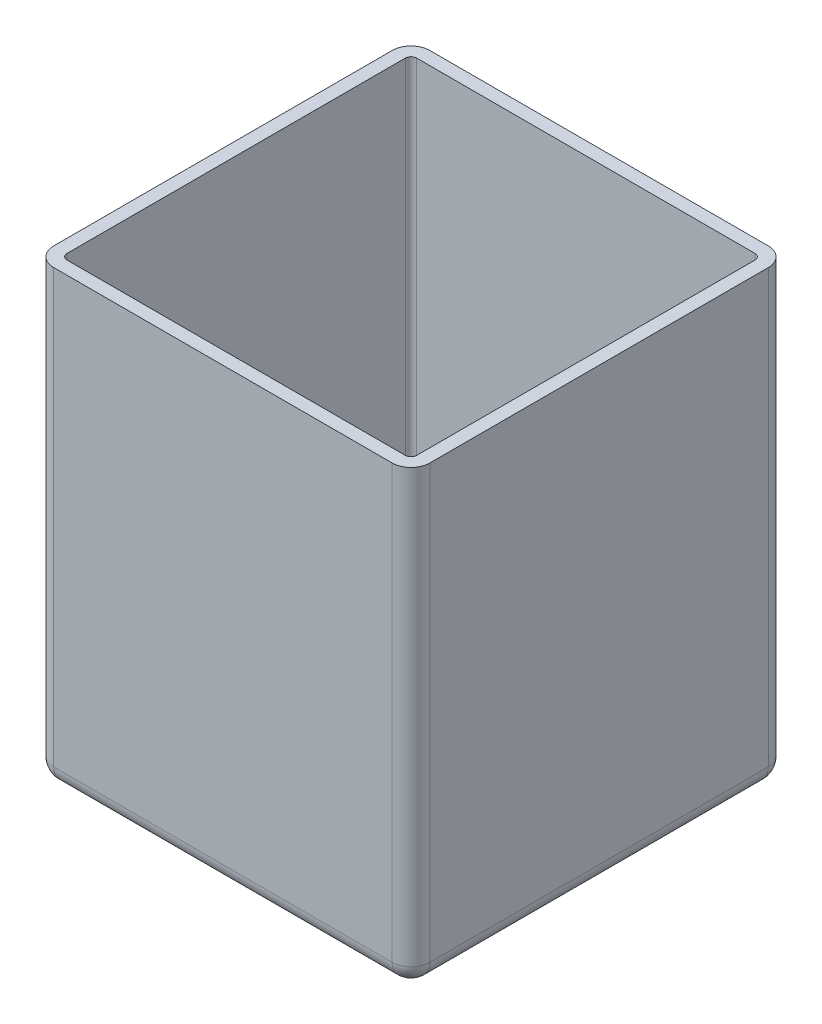
ISO-10303-21;
HEADER;
FILE_DESCRIPTION(('STEP AP214'),'2;1');
FILE_NAME('part.step','',(''),(''),'','','');
FILE_SCHEMA(('AUTOMOTIVE_DESIGN { 1 0 10303 214 1 1 1 1 }'));
ENDSEC;
DATA;
#1=APPLICATION_CONTEXT('core data for automotive mechanical design processes');
#2=APPLICATION_PROTOCOL_DEFINITION('international standard','automotive_design',2000,#1);
#3=PRODUCT_CONTEXT('',#1,'mechanical');
#4=PRODUCT('Part','Part','',(#3));
#5=PRODUCT_RELATED_PRODUCT_CATEGORY('part','',(#4));
#6=PRODUCT_DEFINITION_FORMATION('','',#4);
#7=PRODUCT_DEFINITION_CONTEXT('part definition',#1,'design');
#8=PRODUCT_DEFINITION('design','',#6,#7);
#9=PRODUCT_DEFINITION_SHAPE('','',#8);
#10=(LENGTH_UNIT() NAMED_UNIT(*) SI_UNIT(.MILLI.,.METRE.));
#11=(NAMED_UNIT(*) PLANE_ANGLE_UNIT() SI_UNIT($,.RADIAN.));
#12=(NAMED_UNIT(*) SI_UNIT($,.STERADIAN.) SOLID_ANGLE_UNIT());
#13=UNCERTAINTY_MEASURE_WITH_UNIT(LENGTH_MEASURE(1.E-05),#10,'distance_accuracy_value','');
#14=(GEOMETRIC_REPRESENTATION_CONTEXT(3) GLOBAL_UNCERTAINTY_ASSIGNED_CONTEXT((#13)) GLOBAL_UNIT_ASSIGNED_CONTEXT((#10,
#11,#12)) REPRESENTATION_CONTEXT('',''));
#15=CARTESIAN_POINT('',(0.,0.,0.));
#16=DIRECTION('',(0.,0.,1.));
#17=DIRECTION('',(1.,0.,0.));
#18=AXIS2_PLACEMENT_3D('',#15,#16,#17);
#19=CARTESIAN_POINT('',(-100.,240.,-100.));
#20=DIRECTION('',(1.,0.,0.));
#21=DIRECTION('',(0.,0.,-1.));
#22=AXIS2_PLACEMENT_3D('',#19,#20,#21);
#23=PLANE('',#22);
#24=DIRECTION('',(0.,0.,1.));
#25=VECTOR('',#24,1.);
#26=CARTESIAN_POINT('',(-100.,10.,100.));
#27=LINE('',#26,#25);
#28=CARTESIAN_POINT('',(-100.,10.,-90.));
#29=VERTEX_POINT('',#28);
#30=CARTESIAN_POINT('',(-100.,10.,90.));
#31=VERTEX_POINT('',#30);
#32=EDGE_CURVE('E60',#29,#31,#27,.T.);
#33=ORIENTED_EDGE('',*,*,#32,.T.);
#34=DIRECTION('',(0.,-1.,0.));
#35=VECTOR('',#34,1.);
#36=CARTESIAN_POINT('',(-100.,240.,90.));
#37=LINE('',#36,#35);
#38=CARTESIAN_POINT('',(-100.,240.,90.));
#39=VERTEX_POINT('',#38);
#40=EDGE_CURVE('E288',#31,#39,#37,.F.);
#41=ORIENTED_EDGE('',*,*,#40,.T.);
#42=DIRECTION('',(0.,0.,1.));
#43=VECTOR('',#42,1.);
#44=CARTESIAN_POINT('',(-100.,240.,-100.));
#45=LINE('',#44,#43);
#46=CARTESIAN_POINT('',(-100.,240.,-90.));
#47=VERTEX_POINT('',#46);
#48=EDGE_CURVE('E245',#47,#39,#45,.T.);
#49=ORIENTED_EDGE('',*,*,#48,.F.);
#50=DIRECTION('',(0.,-1.,0.));
#51=VECTOR('',#50,1.);
#52=CARTESIAN_POINT('',(-100.,240.,-90.));
#53=LINE('',#52,#51);
#54=EDGE_CURVE('E285',#47,#29,#53,.T.);
#55=ORIENTED_EDGE('',*,*,#54,.T.);
#56=EDGE_LOOP('',(#33,#41,#49,#55));
#57=FACE_BOUND('',#56,.T.);
#58=ADVANCED_FACE('F35',(#57),#23,.F.);
#59=CARTESIAN_POINT('',(100.,240.,100.));
#60=DIRECTION('',(0.,0.,-1.));
#61=DIRECTION('',(-1.,0.,0.));
#62=AXIS2_PLACEMENT_3D('',#59,#60,#61);
#63=PLANE('',#62);
#64=DIRECTION('',(1.,0.,0.));
#65=VECTOR('',#64,1.);
#66=CARTESIAN_POINT('',(100.,240.,100.));
#67=LINE('',#66,#65);
#68=CARTESIAN_POINT('',(-90.,240.,100.));
#69=VERTEX_POINT('',#68);
#70=CARTESIAN_POINT('',(90.0000000000001,240.,100.));
#71=VERTEX_POINT('',#70);
#72=EDGE_CURVE('E248',#69,#71,#67,.T.);
#73=ORIENTED_EDGE('',*,*,#72,.F.);
#74=DIRECTION('',(0.,-1.,0.));
#75=VECTOR('',#74,1.);
#76=CARTESIAN_POINT('',(-90.,240.,100.));
#77=LINE('',#76,#75);
#78=CARTESIAN_POINT('',(-90.,10.,100.));
#79=VERTEX_POINT('',#78);
#80=EDGE_CURVE('E262',#69,#79,#77,.T.);
#81=ORIENTED_EDGE('',*,*,#80,.T.);
#82=DIRECTION('',(1.,0.,0.));
#83=VECTOR('',#82,1.);
#84=CARTESIAN_POINT('',(100.,10.,100.));
#85=LINE('',#84,#83);
#86=CARTESIAN_POINT('',(90.0000000000001,10.,100.));
#87=VERTEX_POINT('',#86);
#88=EDGE_CURVE('E259',#79,#87,#85,.T.);
#89=ORIENTED_EDGE('',*,*,#88,.T.);
#90=DIRECTION('',(0.,-1.,0.));
#91=VECTOR('',#90,1.);
#92=CARTESIAN_POINT('',(90.0000000000001,240.,100.));
#93=LINE('',#92,#91);
#94=EDGE_CURVE('E257',#87,#71,#93,.F.);
#95=ORIENTED_EDGE('',*,*,#94,.T.);
#96=EDGE_LOOP('',(#73,#81,#89,#95));
#97=FACE_BOUND('',#96,.T.);
#98=ADVANCED_FACE('F387',(#97),#63,.F.);
#99=CARTESIAN_POINT('',(100.,240.,-100.));
#100=DIRECTION('',(-1.,0.,0.));
#101=DIRECTION('',(0.,0.,1.));
#102=AXIS2_PLACEMENT_3D('',#99,#100,#101);
#103=PLANE('',#102);
#104=DIRECTION('',(0.,0.,-1.));
#105=VECTOR('',#104,1.);
#106=CARTESIAN_POINT('',(100.,10.,-100.));
#107=LINE('',#106,#105);
#108=CARTESIAN_POINT('',(100.,10.,90.));
#109=VERTEX_POINT('',#108);
#110=CARTESIAN_POINT('',(100.,10.,-90.));
#111=VERTEX_POINT('',#110);
#112=EDGE_CURVE('E275',#109,#111,#107,.T.);
#113=ORIENTED_EDGE('',*,*,#112,.T.);
#114=DIRECTION('',(0.,-1.,0.));
#115=VECTOR('',#114,1.);
#116=CARTESIAN_POINT('',(100.,240.,-90.));
#117=LINE('',#116,#115);
#118=CARTESIAN_POINT('',(100.,240.,-90.));
#119=VERTEX_POINT('',#118);
#120=EDGE_CURVE('E277',#111,#119,#117,.F.);
#121=ORIENTED_EDGE('',*,*,#120,.T.);
#122=DIRECTION('',(0.,0.,-1.));
#123=VECTOR('',#122,1.);
#124=CARTESIAN_POINT('',(100.,240.,-100.));
#125=LINE('',#124,#123);
#126=CARTESIAN_POINT('',(100.,240.,90.));
#127=VERTEX_POINT('',#126);
#128=EDGE_CURVE('E251',#127,#119,#125,.T.);
#129=ORIENTED_EDGE('',*,*,#128,.F.);
#130=DIRECTION('',(0.,-1.,0.));
#131=VECTOR('',#130,1.);
#132=CARTESIAN_POINT('',(100.,240.,90.));
#133=LINE('',#132,#131);
#134=EDGE_CURVE('E273',#127,#109,#133,.T.);
#135=ORIENTED_EDGE('',*,*,#134,.T.);
#136=EDGE_LOOP('',(#113,#121,#129,#135));
#137=FACE_BOUND('',#136,.T.);
#138=ADVANCED_FACE('F390',(#137),#103,.F.);
#139=CARTESIAN_POINT('',(100.,240.,-100.));
#140=DIRECTION('',(0.,0.,1.));
#141=DIRECTION('',(1.,0.,0.));
#142=AXIS2_PLACEMENT_3D('',#139,#140,#141);
#143=PLANE('',#142);
#144=DIRECTION('',(-1.,0.,0.));
#145=VECTOR('',#144,1.);
#146=CARTESIAN_POINT('',(-100.,10.,-100.));
#147=LINE('',#146,#145);
#148=CARTESIAN_POINT('',(90.,10.,-100.));
#149=VERTEX_POINT('',#148);
#150=CARTESIAN_POINT('',(-90.,10.,-100.));
#151=VERTEX_POINT('',#150);
#152=EDGE_CURVE('E281',#149,#151,#147,.T.);
#153=ORIENTED_EDGE('',*,*,#152,.T.);
#154=DIRECTION('',(0.,-1.,0.));
#155=VECTOR('',#154,1.);
#156=CARTESIAN_POINT('',(-90.,240.,-100.));
#157=LINE('',#156,#155);
#158=CARTESIAN_POINT('',(-90.,240.,-100.));
#159=VERTEX_POINT('',#158);
#160=EDGE_CURVE('E283',#151,#159,#157,.F.);
#161=ORIENTED_EDGE('',*,*,#160,.T.);
#162=DIRECTION('',(-1.,0.,0.));
#163=VECTOR('',#162,1.);
#164=CARTESIAN_POINT('',(100.,240.,-100.));
#165=LINE('',#164,#163);
#166=CARTESIAN_POINT('',(90.,240.,-100.));
#167=VERTEX_POINT('',#166);
#168=EDGE_CURVE('E254',#167,#159,#165,.T.);
#169=ORIENTED_EDGE('',*,*,#168,.F.);
#170=DIRECTION('',(0.,-1.,0.));
#171=VECTOR('',#170,1.);
#172=CARTESIAN_POINT('',(90.,240.,-100.));
#173=LINE('',#172,#171);
#174=EDGE_CURVE('E279',#167,#149,#173,.T.);
#175=ORIENTED_EDGE('',*,*,#174,.T.);
#176=EDGE_LOOP('',(#153,#161,#169,#175));
#177=FACE_BOUND('',#176,.T.);
#178=ADVANCED_FACE('F355',(#177),#143,.F.);
#179=CARTESIAN_POINT('',(0.,240.,0.));
#180=DIRECTION('',(0.,-1.,0.));
#181=DIRECTION('',(0.,0.,-1.));
#182=AXIS2_PLACEMENT_3D('',#179,#180,#181);
#183=PLANE('',#182);
#184=DIRECTION('',(0.,0.,1.));
#185=VECTOR('',#184,1.);
#186=CARTESIAN_POINT('',(-93.,240.,0.));
#187=LINE('',#186,#185);
#188=CARTESIAN_POINT('',(-93.,240.,-90.));
#189=VERTEX_POINT('',#188);
#190=CARTESIAN_POINT('',(-93.,240.,90.));
#191=VERTEX_POINT('',#190);
#192=EDGE_CURVE('E192',#189,#191,#187,.T.);
#193=ORIENTED_EDGE('',*,*,#192,.F.);
#194=CARTESIAN_POINT('',(-90.,240.,-90.));
#195=DIRECTION('',(0.,-1.,0.));
#196=DIRECTION('',(0.,0.,-1.));
#197=AXIS2_PLACEMENT_3D('',#194,#195,#196);
#198=CIRCLE('',#197,3.);
#199=CARTESIAN_POINT('',(-90.,240.,-93.));
#200=VERTEX_POINT('',#199);
#201=EDGE_CURVE('E234',#200,#189,#198,.F.);
#202=ORIENTED_EDGE('',*,*,#201,.F.);
#203=DIRECTION('',(-1.,0.,0.));
#204=VECTOR('',#203,1.);
#205=CARTESIAN_POINT('',(0.,240.,-93.));
#206=LINE('',#205,#204);
#207=CARTESIAN_POINT('',(90.,240.,-93.));
#208=VERTEX_POINT('',#207);
#209=EDGE_CURVE('E52',#208,#200,#206,.T.);
#210=ORIENTED_EDGE('',*,*,#209,.F.);
#211=CARTESIAN_POINT('',(90.,240.,-90.));
#212=DIRECTION('',(0.,-1.,0.));
#213=DIRECTION('',(0.,0.,-1.));
#214=AXIS2_PLACEMENT_3D('',#211,#212,#213);
#215=CIRCLE('',#214,3.);
#216=CARTESIAN_POINT('',(93.,240.,-90.));
#217=VERTEX_POINT('',#216);
#218=EDGE_CURVE('E239',#217,#208,#215,.F.);
#219=ORIENTED_EDGE('',*,*,#218,.F.);
#220=DIRECTION('',(0.,0.,-1.));
#221=VECTOR('',#220,1.);
#222=CARTESIAN_POINT('',(93.,240.,0.));
#223=LINE('',#222,#221);
#224=CARTESIAN_POINT('',(93.,240.,90.));
#225=VERTEX_POINT('',#224);
#226=EDGE_CURVE('E237',#225,#217,#223,.T.);
#227=ORIENTED_EDGE('',*,*,#226,.F.);
#228=CARTESIAN_POINT('',(90.0000000000001,240.,90.));
#229=DIRECTION('',(0.,-1.,0.));
#230=DIRECTION('',(0.,0.,-1.));
#231=AXIS2_PLACEMENT_3D('',#228,#229,#230);
#232=CIRCLE('',#231,3.);
#233=CARTESIAN_POINT('',(90.0000000000001,240.,93.));
#234=VERTEX_POINT('',#233);
#235=EDGE_CURVE('E196',#234,#225,#232,.F.);
#236=ORIENTED_EDGE('',*,*,#235,.F.);
#237=DIRECTION('',(1.,0.,0.));
#238=VECTOR('',#237,1.);
#239=CARTESIAN_POINT('',(0.,240.,93.));
#240=LINE('',#239,#238);
#241=CARTESIAN_POINT('',(-90.,240.,93.));
#242=VERTEX_POINT('',#241);
#243=EDGE_CURVE('E229',#242,#234,#240,.T.);
#244=ORIENTED_EDGE('',*,*,#243,.F.);
#245=CARTESIAN_POINT('',(-90.,240.,90.));
#246=DIRECTION('',(0.,-1.,0.));
#247=DIRECTION('',(0.,0.,-1.));
#248=AXIS2_PLACEMENT_3D('',#245,#246,#247);
#249=CIRCLE('',#248,3.);
#250=EDGE_CURVE('E231',#191,#242,#249,.F.);
#251=ORIENTED_EDGE('',*,*,#250,.F.);
#252=EDGE_LOOP('',(#193,#202,#210,#219,#227,#236,#244,#251));
#253=FACE_BOUND('',#252,.T.);
#254=ORIENTED_EDGE('',*,*,#48,.T.);
#255=CARTESIAN_POINT('',(-90.,240.,90.));
#256=DIRECTION('',(0.,-1.,0.));
#257=DIRECTION('',(0.,0.,-1.));
#258=AXIS2_PLACEMENT_3D('',#255,#256,#257);
#259=CIRCLE('',#258,10.);
#260=EDGE_CURVE('E11',#39,#69,#259,.F.);
#261=ORIENTED_EDGE('',*,*,#260,.T.);
#262=ORIENTED_EDGE('',*,*,#72,.T.);
#263=CARTESIAN_POINT('',(90.0000000000001,240.,90.));
#264=DIRECTION('',(0.,-1.,0.));
#265=DIRECTION('',(0.,0.,-1.));
#266=AXIS2_PLACEMENT_3D('',#263,#264,#265);
#267=CIRCLE('',#266,10.);
#268=EDGE_CURVE('E290',#71,#127,#267,.F.);
#269=ORIENTED_EDGE('',*,*,#268,.T.);
#270=ORIENTED_EDGE('',*,*,#128,.T.);
#271=CARTESIAN_POINT('',(90.,240.,-90.));
#272=DIRECTION('',(0.,-1.,0.));
#273=DIRECTION('',(0.,0.,-1.));
#274=AXIS2_PLACEMENT_3D('',#271,#272,#273);
#275=CIRCLE('',#274,10.);
#276=EDGE_CURVE('E292',#119,#167,#275,.F.);
#277=ORIENTED_EDGE('',*,*,#276,.T.);
#278=ORIENTED_EDGE('',*,*,#168,.T.);
#279=CARTESIAN_POINT('',(-90.,240.,-90.));
#280=DIRECTION('',(0.,-1.,0.));
#281=DIRECTION('',(0.,0.,-1.));
#282=AXIS2_PLACEMENT_3D('',#279,#280,#281);
#283=CIRCLE('',#282,10.);
#284=EDGE_CURVE('E44',#159,#47,#283,.F.);
#285=ORIENTED_EDGE('',*,*,#284,.T.);
#286=EDGE_LOOP('',(#254,#261,#262,#269,#270,#277,#278,#285));
#287=FACE_BOUND('',#286,.T.);
#288=ADVANCED_FACE('F348',(#253,#287),#183,.F.);
#289=CARTESIAN_POINT('',(0.,0.,0.));
#290=DIRECTION('',(0.,-1.,0.));
#291=DIRECTION('',(0.,0.,-1.));
#292=AXIS2_PLACEMENT_3D('',#289,#290,#291);
#293=PLANE('',#292);
#294=DIRECTION('',(0.,0.,-1.));
#295=VECTOR('',#294,1.);
#296=CARTESIAN_POINT('',(90.0000000000001,0.,100.));
#297=LINE('',#296,#295);
#298=CARTESIAN_POINT('',(90.,0.,-90.));
#299=VERTEX_POINT('',#298);
#300=CARTESIAN_POINT('',(90.0000000000001,0.,90.));
#301=VERTEX_POINT('',#300);
#302=EDGE_CURVE('E268',#299,#301,#297,.F.);
#303=ORIENTED_EDGE('',*,*,#302,.T.);
#304=DIRECTION('',(1.,0.,0.));
#305=VECTOR('',#304,1.);
#306=CARTESIAN_POINT('',(-100.,0.,90.));
#307=LINE('',#306,#305);
#308=CARTESIAN_POINT('',(-90.,0.,90.));
#309=VERTEX_POINT('',#308);
#310=EDGE_CURVE('E270',#301,#309,#307,.F.);
#311=ORIENTED_EDGE('',*,*,#310,.T.);
#312=DIRECTION('',(0.,0.,1.));
#313=VECTOR('',#312,1.);
#314=CARTESIAN_POINT('',(-90.,0.,-100.));
#315=LINE('',#314,#313);
#316=CARTESIAN_POINT('',(-90.,0.,-90.));
#317=VERTEX_POINT('',#316);
#318=EDGE_CURVE('E264',#309,#317,#315,.F.);
#319=ORIENTED_EDGE('',*,*,#318,.T.);
#320=DIRECTION('',(-1.,0.,0.));
#321=VECTOR('',#320,1.);
#322=CARTESIAN_POINT('',(100.,0.,-90.));
#323=LINE('',#322,#321);
#324=EDGE_CURVE('E266',#317,#299,#323,.F.);
#325=ORIENTED_EDGE('',*,*,#324,.T.);
#326=EDGE_LOOP('',(#303,#311,#319,#325));
#327=FACE_BOUND('',#326,.T.);
#328=ADVANCED_FACE('F374',(#327),#293,.T.);
#329=CARTESIAN_POINT('',(-90.,240.,-90.));
#330=DIRECTION('',(0.,-1.,0.));
#331=DIRECTION('',(0.,0.,-1.));
#332=AXIS2_PLACEMENT_3D('',#329,#330,#331);
#333=CYLINDRICAL_SURFACE('',#332,10.);
#334=ORIENTED_EDGE('',*,*,#284,.F.);
#335=ORIENTED_EDGE('',*,*,#160,.F.);
#336=CARTESIAN_POINT('',(-90.,10.,-90.));
#337=DIRECTION('',(0.,-1.,0.));
#338=DIRECTION('',(0.,0.,-1.));
#339=AXIS2_PLACEMENT_3D('',#336,#337,#338);
#340=CIRCLE('',#339,10.);
#341=EDGE_CURVE('E321',#29,#151,#340,.T.);
#342=ORIENTED_EDGE('',*,*,#341,.F.);
#343=ORIENTED_EDGE('',*,*,#54,.F.);
#344=EDGE_LOOP('',(#334,#335,#342,#343));
#345=FACE_BOUND('',#344,.T.);
#346=ADVANCED_FACE('F37',(#345),#333,.T.);
#347=CARTESIAN_POINT('',(90.,240.,-90.));
#348=DIRECTION('',(0.,-1.,0.));
#349=DIRECTION('',(0.,0.,-1.));
#350=AXIS2_PLACEMENT_3D('',#347,#348,#349);
#351=CYLINDRICAL_SURFACE('',#350,10.);
#352=ORIENTED_EDGE('',*,*,#276,.F.);
#353=ORIENTED_EDGE('',*,*,#120,.F.);
#354=CARTESIAN_POINT('',(90.,10.,-90.));
#355=DIRECTION('',(0.,-1.,0.));
#356=DIRECTION('',(0.,0.,-1.));
#357=AXIS2_PLACEMENT_3D('',#354,#355,#356);
#358=CIRCLE('',#357,10.);
#359=EDGE_CURVE('E319',#149,#111,#358,.T.);
#360=ORIENTED_EDGE('',*,*,#359,.F.);
#361=ORIENTED_EDGE('',*,*,#174,.F.);
#362=EDGE_LOOP('',(#352,#353,#360,#361));
#363=FACE_BOUND('',#362,.T.);
#364=ADVANCED_FACE('F364',(#363),#351,.T.);
#365=CARTESIAN_POINT('',(100.,10.,-90.));
#366=DIRECTION('',(1.,0.,0.));
#367=DIRECTION('',(0.,0.,-1.));
#368=AXIS2_PLACEMENT_3D('',#365,#366,#367);
#369=CYLINDRICAL_SURFACE('',#368,10.);
#370=CARTESIAN_POINT('',(-90.,10.,-90.));
#371=DIRECTION('',(-1.,0.,0.));
#372=DIRECTION('',(0.,0.,1.));
#373=AXIS2_PLACEMENT_3D('',#370,#371,#372);
#374=CIRCLE('',#373,10.);
#375=EDGE_CURVE('E39',#151,#317,#374,.T.);
#376=ORIENTED_EDGE('',*,*,#375,.F.);
#377=ORIENTED_EDGE('',*,*,#152,.F.);
#378=CARTESIAN_POINT('',(90.,10.,-90.));
#379=DIRECTION('',(1.,0.,0.));
#380=DIRECTION('',(0.,0.,-1.));
#381=AXIS2_PLACEMENT_3D('',#378,#379,#380);
#382=CIRCLE('',#381,10.);
#383=EDGE_CURVE('E316',#299,#149,#382,.T.);
#384=ORIENTED_EDGE('',*,*,#383,.F.);
#385=ORIENTED_EDGE('',*,*,#324,.F.);
#386=EDGE_LOOP('',(#376,#377,#384,#385));
#387=FACE_BOUND('',#386,.T.);
#388=ADVANCED_FACE('F359',(#387),#369,.T.);
#389=CARTESIAN_POINT('',(-90.,10.,-90.));
#390=DIRECTION('',(0.,0.,1.));
#391=DIRECTION('',(1.,0.,0.));
#392=AXIS2_PLACEMENT_3D('',#389,#390,#391);
#393=SPHERICAL_SURFACE('',#392,10.);
#394=ORIENTED_EDGE('',*,*,#341,.T.);
#395=ORIENTED_EDGE('',*,*,#375,.T.);
#396=CARTESIAN_POINT('',(-90.,10.,-90.));
#397=DIRECTION('',(0.,0.,-1.));
#398=DIRECTION('',(-1.,0.,0.));
#399=AXIS2_PLACEMENT_3D('',#396,#397,#398);
#400=CIRCLE('',#399,10.);
#401=EDGE_CURVE('E313',#29,#317,#400,.F.);
#402=ORIENTED_EDGE('',*,*,#401,.F.);
#403=EDGE_LOOP('',(#394,#395,#402));
#404=FACE_BOUND('',#403,.T.);
#405=ADVANCED_FACE('F328',(#404),#393,.T.);
#406=CARTESIAN_POINT('',(90.,10.,-90.));
#407=DIRECTION('',(0.,0.,1.));
#408=DIRECTION('',(1.,0.,0.));
#409=AXIS2_PLACEMENT_3D('',#406,#407,#408);
#410=SPHERICAL_SURFACE('',#409,10.);
#411=ORIENTED_EDGE('',*,*,#383,.T.);
#412=ORIENTED_EDGE('',*,*,#359,.T.);
#413=CARTESIAN_POINT('',(90.,10.,-90.));
#414=DIRECTION('',(0.,0.,-1.));
#415=DIRECTION('',(-1.,0.,0.));
#416=AXIS2_PLACEMENT_3D('',#413,#414,#415);
#417=CIRCLE('',#416,10.);
#418=EDGE_CURVE('E310',#299,#111,#417,.F.);
#419=ORIENTED_EDGE('',*,*,#418,.F.);
#420=EDGE_LOOP('',(#411,#412,#419));
#421=FACE_BOUND('',#420,.T.);
#422=ADVANCED_FACE('F366',(#421),#410,.T.);
#423=CARTESIAN_POINT('',(-90.,10.,-100.));
#424=DIRECTION('',(0.,0.,-1.));
#425=DIRECTION('',(-1.,0.,0.));
#426=AXIS2_PLACEMENT_3D('',#423,#424,#425);
#427=CYLINDRICAL_SURFACE('',#426,10.);
#428=ORIENTED_EDGE('',*,*,#401,.T.);
#429=ORIENTED_EDGE('',*,*,#318,.F.);
#430=CARTESIAN_POINT('',(-90.,10.,90.));
#431=DIRECTION('',(0.,0.,1.));
#432=DIRECTION('',(1.,0.,0.));
#433=AXIS2_PLACEMENT_3D('',#430,#431,#432);
#434=CIRCLE('',#433,10.);
#435=EDGE_CURVE('E307',#31,#309,#434,.T.);
#436=ORIENTED_EDGE('',*,*,#435,.F.);
#437=ORIENTED_EDGE('',*,*,#32,.F.);
#438=EDGE_LOOP('',(#428,#429,#436,#437));
#439=FACE_BOUND('',#438,.T.);
#440=ADVANCED_FACE('F334',(#439),#427,.T.);
#441=CARTESIAN_POINT('',(-90.,240.,90.));
#442=DIRECTION('',(0.,-1.,0.));
#443=DIRECTION('',(0.,0.,-1.));
#444=AXIS2_PLACEMENT_3D('',#441,#442,#443);
#445=CYLINDRICAL_SURFACE('',#444,10.);
#446=ORIENTED_EDGE('',*,*,#260,.F.);
#447=ORIENTED_EDGE('',*,*,#40,.F.);
#448=CARTESIAN_POINT('',(-90.,10.,90.));
#449=DIRECTION('',(0.,-1.,0.));
#450=DIRECTION('',(0.,0.,-1.));
#451=AXIS2_PLACEMENT_3D('',#448,#449,#450);
#452=CIRCLE('',#451,10.);
#453=EDGE_CURVE('E304',#79,#31,#452,.T.);
#454=ORIENTED_EDGE('',*,*,#453,.F.);
#455=ORIENTED_EDGE('',*,*,#80,.F.);
#456=EDGE_LOOP('',(#446,#447,#454,#455));
#457=FACE_BOUND('',#456,.T.);
#458=ADVANCED_FACE('F344',(#457),#445,.T.);
#459=CARTESIAN_POINT('',(90.0000000000001,240.,90.));
#460=DIRECTION('',(0.,-1.,0.));
#461=DIRECTION('',(0.,0.,-1.));
#462=AXIS2_PLACEMENT_3D('',#459,#460,#461);
#463=CYLINDRICAL_SURFACE('',#462,10.);
#464=ORIENTED_EDGE('',*,*,#268,.F.);
#465=ORIENTED_EDGE('',*,*,#94,.F.);
#466=CARTESIAN_POINT('',(90.0000000000001,10.,90.));
#467=DIRECTION('',(0.,-1.,0.));
#468=DIRECTION('',(0.,0.,-1.));
#469=AXIS2_PLACEMENT_3D('',#466,#467,#468);
#470=CIRCLE('',#469,10.);
#471=EDGE_CURVE('E301',#109,#87,#470,.T.);
#472=ORIENTED_EDGE('',*,*,#471,.F.);
#473=ORIENTED_EDGE('',*,*,#134,.F.);
#474=EDGE_LOOP('',(#464,#465,#472,#473));
#475=FACE_BOUND('',#474,.T.);
#476=ADVANCED_FACE('F385',(#475),#463,.T.);
#477=CARTESIAN_POINT('',(90.,10.,-100.));
#478=DIRECTION('',(0.,0.,1.));
#479=DIRECTION('',(1.,0.,0.));
#480=AXIS2_PLACEMENT_3D('',#477,#478,#479);
#481=CYLINDRICAL_SURFACE('',#480,10.);
#482=ORIENTED_EDGE('',*,*,#418,.T.);
#483=ORIENTED_EDGE('',*,*,#112,.F.);
#484=CARTESIAN_POINT('',(90.0000000000001,10.,90.));
#485=DIRECTION('',(0.,0.,1.));
#486=DIRECTION('',(1.,0.,0.));
#487=AXIS2_PLACEMENT_3D('',#484,#485,#486);
#488=CIRCLE('',#487,10.);
#489=EDGE_CURVE('E298',#301,#109,#488,.T.);
#490=ORIENTED_EDGE('',*,*,#489,.F.);
#491=ORIENTED_EDGE('',*,*,#302,.F.);
#492=EDGE_LOOP('',(#482,#483,#490,#491));
#493=FACE_BOUND('',#492,.T.);
#494=ADVANCED_FACE('F371',(#493),#481,.T.);
#495=CARTESIAN_POINT('',(-90.,10.,90.));
#496=DIRECTION('',(0.,0.,1.));
#497=DIRECTION('',(1.,0.,0.));
#498=AXIS2_PLACEMENT_3D('',#495,#496,#497);
#499=SPHERICAL_SURFACE('',#498,10.);
#500=ORIENTED_EDGE('',*,*,#453,.T.);
#501=ORIENTED_EDGE('',*,*,#435,.T.);
#502=CARTESIAN_POINT('',(-90.,10.,90.));
#503=DIRECTION('',(-1.,0.,0.));
#504=DIRECTION('',(0.,0.,1.));
#505=AXIS2_PLACEMENT_3D('',#502,#503,#504);
#506=CIRCLE('',#505,10.);
#507=EDGE_CURVE('E296',#79,#309,#506,.F.);
#508=ORIENTED_EDGE('',*,*,#507,.F.);
#509=EDGE_LOOP('',(#500,#501,#508));
#510=FACE_BOUND('',#509,.T.);
#511=ADVANCED_FACE('F339',(#510),#499,.T.);
#512=CARTESIAN_POINT('',(90.0000000000001,10.,90.));
#513=DIRECTION('',(0.,0.,1.));
#514=DIRECTION('',(1.,0.,0.));
#515=AXIS2_PLACEMENT_3D('',#512,#513,#514);
#516=SPHERICAL_SURFACE('',#515,10.);
#517=ORIENTED_EDGE('',*,*,#489,.T.);
#518=ORIENTED_EDGE('',*,*,#471,.T.);
#519=CARTESIAN_POINT('',(90.0000000000001,10.,90.));
#520=DIRECTION('',(1.,0.,0.));
#521=DIRECTION('',(0.,0.,-1.));
#522=AXIS2_PLACEMENT_3D('',#519,#520,#521);
#523=CIRCLE('',#522,10.);
#524=EDGE_CURVE('E233',#301,#87,#523,.F.);
#525=ORIENTED_EDGE('',*,*,#524,.F.);
#526=EDGE_LOOP('',(#517,#518,#525));
#527=FACE_BOUND('',#526,.T.);
#528=ADVANCED_FACE('F379',(#527),#516,.T.);
#529=CARTESIAN_POINT('',(100.,10.,90.));
#530=DIRECTION('',(-1.,0.,0.));
#531=DIRECTION('',(0.,0.,1.));
#532=AXIS2_PLACEMENT_3D('',#529,#530,#531);
#533=CYLINDRICAL_SURFACE('',#532,10.);
#534=ORIENTED_EDGE('',*,*,#507,.T.);
#535=ORIENTED_EDGE('',*,*,#310,.F.);
#536=ORIENTED_EDGE('',*,*,#524,.T.);
#537=ORIENTED_EDGE('',*,*,#88,.F.);
#538=EDGE_LOOP('',(#534,#535,#536,#537));
#539=FACE_BOUND('',#538,.T.);
#540=ADVANCED_FACE('F377',(#539),#533,.T.);
#541=CARTESIAN_POINT('',(-93.,240.,-100.));
#542=DIRECTION('',(1.,0.,0.));
#543=DIRECTION('',(0.,0.,-1.));
#544=AXIS2_PLACEMENT_3D('',#541,#542,#543);
#545=PLANE('',#544);
#546=DIRECTION('',(0.,0.,-1.));
#547=VECTOR('',#546,1.);
#548=CARTESIAN_POINT('',(-93.,10.0000000000001,-100.));
#549=LINE('',#548,#547);
#550=CARTESIAN_POINT('',(-93.,10.0000000000001,-90.));
#551=VERTEX_POINT('',#550);
#552=CARTESIAN_POINT('',(-93.,10.0000000000001,90.));
#553=VERTEX_POINT('',#552);
#554=EDGE_CURVE('E176',#551,#553,#549,.F.);
#555=ORIENTED_EDGE('',*,*,#554,.F.);
#556=DIRECTION('',(0.,1.,0.));
#557=VECTOR('',#556,1.);
#558=CARTESIAN_POINT('',(-93.,240.,-90.));
#559=LINE('',#558,#557);
#560=EDGE_CURVE('E187',#189,#551,#559,.F.);
#561=ORIENTED_EDGE('',*,*,#560,.F.);
#562=ORIENTED_EDGE('',*,*,#192,.T.);
#563=DIRECTION('',(0.,1.,0.));
#564=VECTOR('',#563,1.);
#565=CARTESIAN_POINT('',(-93.,240.,90.));
#566=LINE('',#565,#564);
#567=EDGE_CURVE('E186',#553,#191,#566,.T.);
#568=ORIENTED_EDGE('',*,*,#567,.F.);
#569=EDGE_LOOP('',(#555,#561,#562,#568));
#570=FACE_BOUND('',#569,.T.);
#571=ADVANCED_FACE('F190',(#570),#545,.T.);
#572=CARTESIAN_POINT('',(100.,240.,93.));
#573=DIRECTION('',(0.,0.,-1.));
#574=DIRECTION('',(-1.,0.,0.));
#575=AXIS2_PLACEMENT_3D('',#572,#573,#574);
#576=PLANE('',#575);
#577=ORIENTED_EDGE('',*,*,#243,.T.);
#578=DIRECTION('',(0.,1.,0.));
#579=VECTOR('',#578,1.);
#580=CARTESIAN_POINT('',(90.0000000000001,240.,93.));
#581=LINE('',#580,#579);
#582=CARTESIAN_POINT('',(90.0000000000001,10.,93.));
#583=VERTEX_POINT('',#582);
#584=EDGE_CURVE('E221',#583,#234,#581,.T.);
#585=ORIENTED_EDGE('',*,*,#584,.F.);
#586=DIRECTION('',(-1.,0.,0.));
#587=VECTOR('',#586,1.);
#588=CARTESIAN_POINT('',(100.,10.,93.));
#589=LINE('',#588,#587);
#590=CARTESIAN_POINT('',(-90.,10.,93.));
#591=VERTEX_POINT('',#590);
#592=EDGE_CURVE('E218',#591,#583,#589,.F.);
#593=ORIENTED_EDGE('',*,*,#592,.F.);
#594=DIRECTION('',(0.,1.,0.));
#595=VECTOR('',#594,1.);
#596=CARTESIAN_POINT('',(-90.,240.,93.));
#597=LINE('',#596,#595);
#598=EDGE_CURVE('E208',#242,#591,#597,.F.);
#599=ORIENTED_EDGE('',*,*,#598,.F.);
#600=EDGE_LOOP('',(#577,#585,#593,#599));
#601=FACE_BOUND('',#600,.T.);
#602=ADVANCED_FACE('F489',(#601),#576,.T.);
#603=CARTESIAN_POINT('',(93.,240.,-100.));
#604=DIRECTION('',(-1.,0.,0.));
#605=DIRECTION('',(0.,0.,1.));
#606=AXIS2_PLACEMENT_3D('',#603,#604,#605);
#607=PLANE('',#606);
#608=DIRECTION('',(0.,0.,1.));
#609=VECTOR('',#608,1.);
#610=CARTESIAN_POINT('',(93.,10.,-100.));
#611=LINE('',#610,#609);
#612=CARTESIAN_POINT('',(93.,10.,90.));
#613=VERTEX_POINT('',#612);
#614=CARTESIAN_POINT('',(93.,10.,-90.));
#615=VERTEX_POINT('',#614);
#616=EDGE_CURVE('E705',#613,#615,#611,.F.);
#617=ORIENTED_EDGE('',*,*,#616,.F.);
#618=DIRECTION('',(0.,1.,0.));
#619=VECTOR('',#618,1.);
#620=CARTESIAN_POINT('',(93.,240.,90.));
#621=LINE('',#620,#619);
#622=EDGE_CURVE('E702',#225,#613,#621,.F.);
#623=ORIENTED_EDGE('',*,*,#622,.F.);
#624=ORIENTED_EDGE('',*,*,#226,.T.);
#625=DIRECTION('',(0.,1.,0.));
#626=VECTOR('',#625,1.);
#627=CARTESIAN_POINT('',(93.,240.,-90.));
#628=LINE('',#627,#626);
#629=EDGE_CURVE('E709',#615,#217,#628,.T.);
#630=ORIENTED_EDGE('',*,*,#629,.F.);
#631=EDGE_LOOP('',(#617,#623,#624,#630));
#632=FACE_BOUND('',#631,.T.);
#633=ADVANCED_FACE('F486',(#632),#607,.T.);
#634=CARTESIAN_POINT('',(100.,240.,-93.));
#635=DIRECTION('',(0.,0.,1.));
#636=DIRECTION('',(1.,0.,0.));
#637=AXIS2_PLACEMENT_3D('',#634,#635,#636);
#638=PLANE('',#637);
#639=DIRECTION('',(1.,0.,0.));
#640=VECTOR('',#639,1.);
#641=CARTESIAN_POINT('',(100.,10.,-93.));
#642=LINE('',#641,#640);
#643=CARTESIAN_POINT('',(90.,10.,-93.));
#644=VERTEX_POINT('',#643);
#645=CARTESIAN_POINT('',(-90.,10.,-93.));
#646=VERTEX_POINT('',#645);
#647=EDGE_CURVE('E737',#644,#646,#642,.F.);
#648=ORIENTED_EDGE('',*,*,#647,.F.);
#649=DIRECTION('',(0.,1.,0.));
#650=VECTOR('',#649,1.);
#651=CARTESIAN_POINT('',(90.,240.,-93.));
#652=LINE('',#651,#650);
#653=EDGE_CURVE('E739',#208,#644,#652,.F.);
#654=ORIENTED_EDGE('',*,*,#653,.F.);
#655=ORIENTED_EDGE('',*,*,#209,.T.);
#656=DIRECTION('',(0.,1.,0.));
#657=VECTOR('',#656,1.);
#658=CARTESIAN_POINT('',(-90.,240.,-93.));
#659=LINE('',#658,#657);
#660=EDGE_CURVE('E735',#646,#200,#659,.T.);
#661=ORIENTED_EDGE('',*,*,#660,.F.);
#662=EDGE_LOOP('',(#648,#654,#655,#661));
#663=FACE_BOUND('',#662,.T.);
#664=ADVANCED_FACE('F482',(#663),#638,.T.);
#665=CARTESIAN_POINT('',(0.,7.,0.));
#666=DIRECTION('',(0.,-1.,0.));
#667=DIRECTION('',(0.,0.,-1.));
#668=AXIS2_PLACEMENT_3D('',#665,#666,#667);
#669=PLANE('',#668);
#670=DIRECTION('',(0.,0.,-1.));
#671=VECTOR('',#670,1.);
#672=CARTESIAN_POINT('',(90.,7.,0.));
#673=LINE('',#672,#671);
#674=CARTESIAN_POINT('',(90.,7.,-90.));
#675=VERTEX_POINT('',#674);
#676=CARTESIAN_POINT('',(90.0000000000001,7.,90.));
#677=VERTEX_POINT('',#676);
#678=EDGE_CURVE('E712',#675,#677,#673,.F.);
#679=ORIENTED_EDGE('',*,*,#678,.F.);
#680=DIRECTION('',(1.,0.,0.));
#681=VECTOR('',#680,1.);
#682=CARTESIAN_POINT('',(0.,7.,-90.));
#683=LINE('',#682,#681);
#684=CARTESIAN_POINT('',(-90.,7.,-90.));
#685=VERTEX_POINT('',#684);
#686=EDGE_CURVE('E722',#685,#675,#683,.T.);
#687=ORIENTED_EDGE('',*,*,#686,.F.);
#688=DIRECTION('',(0.,0.,-1.));
#689=VECTOR('',#688,1.);
#690=CARTESIAN_POINT('',(-90.,7.,0.));
#691=LINE('',#690,#689);
#692=CARTESIAN_POINT('',(-90.,7.00000000000001,90.));
#693=VERTEX_POINT('',#692);
#694=EDGE_CURVE('E217',#693,#685,#691,.T.);
#695=ORIENTED_EDGE('',*,*,#694,.F.);
#696=DIRECTION('',(1.,0.,0.));
#697=VECTOR('',#696,1.);
#698=CARTESIAN_POINT('',(0.,7.,90.));
#699=LINE('',#698,#697);
#700=EDGE_CURVE('E707',#677,#693,#699,.F.);
#701=ORIENTED_EDGE('',*,*,#700,.F.);
#702=EDGE_LOOP('',(#679,#687,#695,#701));
#703=FACE_BOUND('',#702,.T.);
#704=ADVANCED_FACE('F478',(#703),#669,.F.);
#705=CARTESIAN_POINT('',(-90.,240.,-90.));
#706=DIRECTION('',(0.,-1.,0.));
#707=DIRECTION('',(0.,0.,-1.));
#708=AXIS2_PLACEMENT_3D('',#705,#706,#707);
#709=CYLINDRICAL_SURFACE('',#708,3.);
#710=ORIENTED_EDGE('',*,*,#201,.T.);
#711=ORIENTED_EDGE('',*,*,#560,.T.);
#712=CARTESIAN_POINT('',(-90.,10.,-90.));
#713=DIRECTION('',(0.,1.,0.));
#714=DIRECTION('',(-1.,0.,0.));
#715=AXIS2_PLACEMENT_3D('',#712,#713,#714);
#716=CIRCLE('',#715,3.);
#717=EDGE_CURVE('E727',#551,#646,#716,.F.);
#718=ORIENTED_EDGE('',*,*,#717,.T.);
#719=ORIENTED_EDGE('',*,*,#660,.T.);
#720=EDGE_LOOP('',(#710,#711,#718,#719));
#721=FACE_BOUND('',#720,.T.);
#722=ADVANCED_FACE('F474',(#721),#709,.F.);
#723=CARTESIAN_POINT('',(90.,240.,-90.));
#724=DIRECTION('',(0.,-1.,0.));
#725=DIRECTION('',(0.,0.,-1.));
#726=AXIS2_PLACEMENT_3D('',#723,#724,#725);
#727=CYLINDRICAL_SURFACE('',#726,3.);
#728=ORIENTED_EDGE('',*,*,#218,.T.);
#729=ORIENTED_EDGE('',*,*,#653,.T.);
#730=CARTESIAN_POINT('',(90.,10.,-90.));
#731=DIRECTION('',(0.,-1.,0.));
#732=DIRECTION('',(1.,0.,0.));
#733=AXIS2_PLACEMENT_3D('',#730,#731,#732);
#734=CIRCLE('',#733,3.);
#735=EDGE_CURVE('E719',#644,#615,#734,.T.);
#736=ORIENTED_EDGE('',*,*,#735,.T.);
#737=ORIENTED_EDGE('',*,*,#629,.T.);
#738=EDGE_LOOP('',(#728,#729,#736,#737));
#739=FACE_BOUND('',#738,.T.);
#740=ADVANCED_FACE('F470',(#739),#727,.F.);
#741=CARTESIAN_POINT('',(100.,10.,-90.));
#742=DIRECTION('',(1.,0.,0.));
#743=DIRECTION('',(0.,0.,-1.));
#744=AXIS2_PLACEMENT_3D('',#741,#742,#743);
#745=CYLINDRICAL_SURFACE('',#744,3.);
#746=CARTESIAN_POINT('',(-90.,10.,-90.));
#747=DIRECTION('',(-1.,0.,0.));
#748=DIRECTION('',(0.,-1.,0.));
#749=AXIS2_PLACEMENT_3D('',#746,#747,#748);
#750=CIRCLE('',#749,3.);
#751=EDGE_CURVE('E230',#646,#685,#750,.T.);
#752=ORIENTED_EDGE('',*,*,#751,.T.);
#753=ORIENTED_EDGE('',*,*,#686,.T.);
#754=CARTESIAN_POINT('',(90.,10.,-90.));
#755=DIRECTION('',(-1.,0.,0.));
#756=DIRECTION('',(0.,-1.,0.));
#757=AXIS2_PLACEMENT_3D('',#754,#755,#756);
#758=CIRCLE('',#757,3.);
#759=EDGE_CURVE('E716',#675,#644,#758,.F.);
#760=ORIENTED_EDGE('',*,*,#759,.T.);
#761=ORIENTED_EDGE('',*,*,#647,.T.);
#762=EDGE_LOOP('',(#752,#753,#760,#761));
#763=FACE_BOUND('',#762,.T.);
#764=ADVANCED_FACE('F466',(#763),#745,.F.);
#765=CARTESIAN_POINT('',(-90.,10.,-90.));
#766=DIRECTION('',(0.,0.,1.));
#767=DIRECTION('',(1.,0.,0.));
#768=AXIS2_PLACEMENT_3D('',#765,#766,#767);
#769=SPHERICAL_SURFACE('',#768,3.);
#770=ORIENTED_EDGE('',*,*,#717,.F.);
#771=CARTESIAN_POINT('',(-90.,10.,-90.));
#772=DIRECTION('',(0.,0.,-1.));
#773=DIRECTION('',(-1.,0.,0.));
#774=AXIS2_PLACEMENT_3D('',#771,#772,#773);
#775=CIRCLE('',#774,3.);
#776=EDGE_CURVE('E183',#551,#685,#775,.F.);
#777=ORIENTED_EDGE('',*,*,#776,.T.);
#778=ORIENTED_EDGE('',*,*,#751,.F.);
#779=EDGE_LOOP('',(#770,#777,#778));
#780=FACE_BOUND('',#779,.T.);
#781=ADVANCED_FACE('F462',(#780),#769,.F.);
#782=CARTESIAN_POINT('',(90.,10.,-90.));
#783=DIRECTION('',(0.,0.,1.));
#784=DIRECTION('',(1.,0.,0.));
#785=AXIS2_PLACEMENT_3D('',#782,#783,#784);
#786=SPHERICAL_SURFACE('',#785,3.);
#787=ORIENTED_EDGE('',*,*,#759,.F.);
#788=CARTESIAN_POINT('',(90.,10.,-90.));
#789=DIRECTION('',(0.,0.,1.));
#790=DIRECTION('',(1.,0.,0.));
#791=AXIS2_PLACEMENT_3D('',#788,#789,#790);
#792=CIRCLE('',#791,3.);
#793=EDGE_CURVE('E204',#675,#615,#792,.T.);
#794=ORIENTED_EDGE('',*,*,#793,.T.);
#795=ORIENTED_EDGE('',*,*,#735,.F.);
#796=EDGE_LOOP('',(#787,#794,#795));
#797=FACE_BOUND('',#796,.T.);
#798=ADVANCED_FACE('F459',(#797),#786,.F.);
#799=CARTESIAN_POINT('',(-90.,10.,-100.));
#800=DIRECTION('',(0.,0.,-1.));
#801=DIRECTION('',(-1.,0.,0.));
#802=AXIS2_PLACEMENT_3D('',#799,#800,#801);
#803=CYLINDRICAL_SURFACE('',#802,3.);
#804=ORIENTED_EDGE('',*,*,#776,.F.);
#805=ORIENTED_EDGE('',*,*,#554,.T.);
#806=CARTESIAN_POINT('',(-90.,10.,90.));
#807=DIRECTION('',(0.,0.,1.));
#808=DIRECTION('',(1.,0.,0.));
#809=AXIS2_PLACEMENT_3D('',#806,#807,#808);
#810=CIRCLE('',#809,3.);
#811=EDGE_CURVE('E180',#553,#693,#810,.T.);
#812=ORIENTED_EDGE('',*,*,#811,.T.);
#813=ORIENTED_EDGE('',*,*,#694,.T.);
#814=EDGE_LOOP('',(#804,#805,#812,#813));
#815=FACE_BOUND('',#814,.T.);
#816=ADVANCED_FACE('F178',(#815),#803,.F.);
#817=CARTESIAN_POINT('',(-90.,240.,90.));
#818=DIRECTION('',(0.,-1.,0.));
#819=DIRECTION('',(0.,0.,-1.));
#820=AXIS2_PLACEMENT_3D('',#817,#818,#819);
#821=CYLINDRICAL_SURFACE('',#820,3.);
#822=ORIENTED_EDGE('',*,*,#250,.T.);
#823=ORIENTED_EDGE('',*,*,#598,.T.);
#824=CARTESIAN_POINT('',(-90.,10.,90.));
#825=DIRECTION('',(0.,1.,0.));
#826=DIRECTION('',(-1.,0.,0.));
#827=AXIS2_PLACEMENT_3D('',#824,#825,#826);
#828=CIRCLE('',#827,3.);
#829=EDGE_CURVE('E201',#591,#553,#828,.F.);
#830=ORIENTED_EDGE('',*,*,#829,.T.);
#831=ORIENTED_EDGE('',*,*,#567,.T.);
#832=EDGE_LOOP('',(#822,#823,#830,#831));
#833=FACE_BOUND('',#832,.T.);
#834=ADVANCED_FACE('F206',(#833),#821,.F.);
#835=CARTESIAN_POINT('',(90.0000000000001,240.,90.));
#836=DIRECTION('',(0.,-1.,0.));
#837=DIRECTION('',(0.,0.,-1.));
#838=AXIS2_PLACEMENT_3D('',#835,#836,#837);
#839=CYLINDRICAL_SURFACE('',#838,3.);
#840=ORIENTED_EDGE('',*,*,#235,.T.);
#841=ORIENTED_EDGE('',*,*,#622,.T.);
#842=CARTESIAN_POINT('',(90.0000000000001,10.,90.));
#843=DIRECTION('',(0.,-1.,0.));
#844=DIRECTION('',(1.,0.,0.));
#845=AXIS2_PLACEMENT_3D('',#842,#843,#844);
#846=CIRCLE('',#845,3.);
#847=EDGE_CURVE('E209',#613,#583,#846,.T.);
#848=ORIENTED_EDGE('',*,*,#847,.T.);
#849=ORIENTED_EDGE('',*,*,#584,.T.);
#850=EDGE_LOOP('',(#840,#841,#848,#849));
#851=FACE_BOUND('',#850,.T.);
#852=ADVANCED_FACE('F450',(#851),#839,.F.);
#853=CARTESIAN_POINT('',(90.,10.,-100.));
#854=DIRECTION('',(0.,0.,1.));
#855=DIRECTION('',(1.,0.,0.));
#856=AXIS2_PLACEMENT_3D('',#853,#854,#855);
#857=CYLINDRICAL_SURFACE('',#856,3.);
#858=ORIENTED_EDGE('',*,*,#793,.F.);
#859=ORIENTED_EDGE('',*,*,#678,.T.);
#860=CARTESIAN_POINT('',(90.0000000000001,10.,90.));
#861=DIRECTION('',(0.,0.,1.));
#862=DIRECTION('',(1.,0.,0.));
#863=AXIS2_PLACEMENT_3D('',#860,#861,#862);
#864=CIRCLE('',#863,3.);
#865=EDGE_CURVE('E212',#677,#613,#864,.T.);
#866=ORIENTED_EDGE('',*,*,#865,.T.);
#867=ORIENTED_EDGE('',*,*,#616,.T.);
#868=EDGE_LOOP('',(#858,#859,#866,#867));
#869=FACE_BOUND('',#868,.T.);
#870=ADVANCED_FACE('F447',(#869),#857,.F.);
#871=CARTESIAN_POINT('',(-90.,10.,90.));
#872=DIRECTION('',(0.,0.,1.));
#873=DIRECTION('',(1.,0.,0.));
#874=AXIS2_PLACEMENT_3D('',#871,#872,#873);
#875=SPHERICAL_SURFACE('',#874,3.);
#876=ORIENTED_EDGE('',*,*,#829,.F.);
#877=CARTESIAN_POINT('',(-90.,10.,90.));
#878=DIRECTION('',(-1.,0.,0.));
#879=DIRECTION('',(0.,0.,1.));
#880=AXIS2_PLACEMENT_3D('',#877,#878,#879);
#881=CIRCLE('',#880,3.);
#882=EDGE_CURVE('E203',#591,#693,#881,.F.);
#883=ORIENTED_EDGE('',*,*,#882,.T.);
#884=ORIENTED_EDGE('',*,*,#811,.F.);
#885=EDGE_LOOP('',(#876,#883,#884));
#886=FACE_BOUND('',#885,.T.);
#887=ADVANCED_FACE('F200',(#886),#875,.F.);
#888=CARTESIAN_POINT('',(90.0000000000001,10.,90.));
#889=DIRECTION('',(0.,0.,1.));
#890=DIRECTION('',(1.,0.,0.));
#891=AXIS2_PLACEMENT_3D('',#888,#889,#890);
#892=SPHERICAL_SURFACE('',#891,3.);
#893=ORIENTED_EDGE('',*,*,#865,.F.);
#894=CARTESIAN_POINT('',(90.0000000000001,10.,90.));
#895=DIRECTION('',(-1.,0.,0.));
#896=DIRECTION('',(0.,0.,1.));
#897=AXIS2_PLACEMENT_3D('',#894,#895,#896);
#898=CIRCLE('',#897,3.);
#899=EDGE_CURVE('E225',#677,#583,#898,.T.);
#900=ORIENTED_EDGE('',*,*,#899,.T.);
#901=ORIENTED_EDGE('',*,*,#847,.F.);
#902=EDGE_LOOP('',(#893,#900,#901));
#903=FACE_BOUND('',#902,.T.);
#904=ADVANCED_FACE('F440',(#903),#892,.F.);
#905=CARTESIAN_POINT('',(100.,10.,90.));
#906=DIRECTION('',(-1.,0.,0.));
#907=DIRECTION('',(0.,0.,1.));
#908=AXIS2_PLACEMENT_3D('',#905,#906,#907);
#909=CYLINDRICAL_SURFACE('',#908,3.);
#910=ORIENTED_EDGE('',*,*,#882,.F.);
#911=ORIENTED_EDGE('',*,*,#592,.T.);
#912=ORIENTED_EDGE('',*,*,#899,.F.);
#913=ORIENTED_EDGE('',*,*,#700,.T.);
#914=EDGE_LOOP('',(#910,#911,#912,#913));
#915=FACE_BOUND('',#914,.T.);
#916=ADVANCED_FACE('F437',(#915),#909,.F.);
#917=CLOSED_SHELL('',(#58,#98,#138,#178,#288,#328,#346,#364,#388,#405,#422,#440,#458,#476,#494,
#511,#528,#540,#571,#602,#633,#664,#704,#722,#740,#764,#781,#798,#816,#834,#852,#870,#887,#904,#916));
#918=MANIFOLD_SOLID_BREP('B2',#917);
#919=ADVANCED_BREP_SHAPE_REPRESENTATION('',(#18,#918),#14);
#920=SHAPE_DEFINITION_REPRESENTATION(#9,#919);
ENDSEC;
END-ISO-10303-21;
